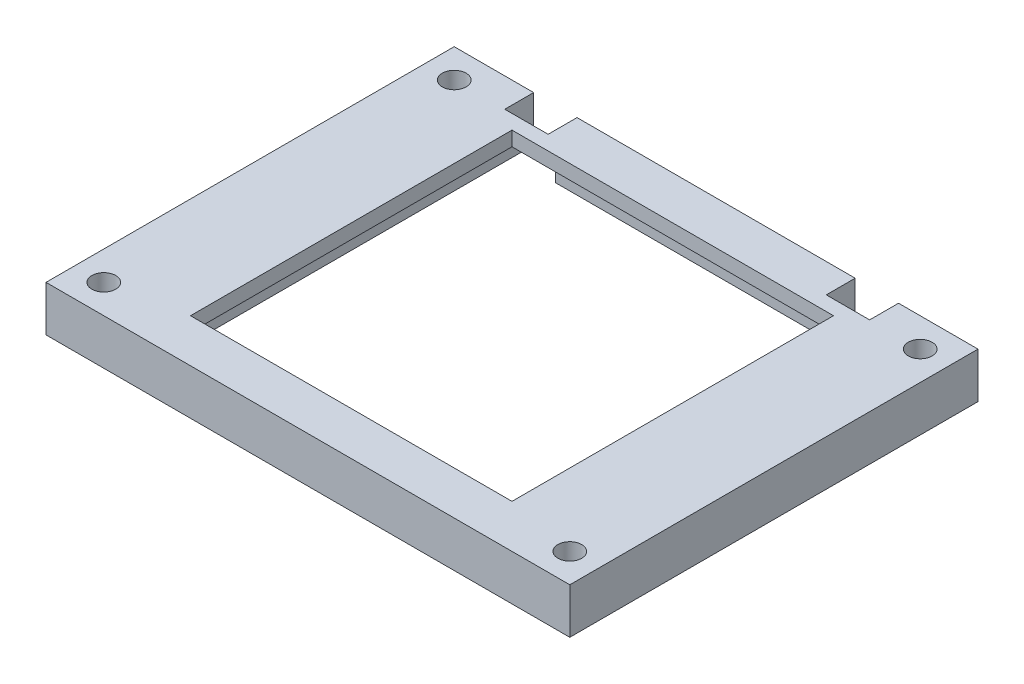
ISO-10303-21;
HEADER;
FILE_DESCRIPTION(('STEP AP214'),'2;1');
FILE_NAME('part.step','',(''),(''),'','','');
FILE_SCHEMA(('AUTOMOTIVE_DESIGN { 1 0 10303 214 1 1 1 1 }'));
ENDSEC;
DATA;
#1=APPLICATION_CONTEXT('core data for automotive mechanical design processes');
#2=APPLICATION_PROTOCOL_DEFINITION('international standard','automotive_design',2000,#1);
#3=PRODUCT_CONTEXT('',#1,'mechanical');
#4=PRODUCT('Part','Part','',(#3));
#5=PRODUCT_RELATED_PRODUCT_CATEGORY('part','',(#4));
#6=PRODUCT_DEFINITION_FORMATION('','',#4);
#7=PRODUCT_DEFINITION_CONTEXT('part definition',#1,'design');
#8=PRODUCT_DEFINITION('design','',#6,#7);
#9=PRODUCT_DEFINITION_SHAPE('','',#8);
#10=(LENGTH_UNIT() NAMED_UNIT(*) SI_UNIT(.MILLI.,.METRE.));
#11=(NAMED_UNIT(*) PLANE_ANGLE_UNIT() SI_UNIT($,.RADIAN.));
#12=(NAMED_UNIT(*) SI_UNIT($,.STERADIAN.) SOLID_ANGLE_UNIT());
#13=UNCERTAINTY_MEASURE_WITH_UNIT(LENGTH_MEASURE(1.E-05),#10,'distance_accuracy_value','');
#14=(GEOMETRIC_REPRESENTATION_CONTEXT(3) GLOBAL_UNCERTAINTY_ASSIGNED_CONTEXT((#13)) GLOBAL_UNIT_ASSIGNED_CONTEXT((#10,
#11,#12)) REPRESENTATION_CONTEXT('',''));
#15=CARTESIAN_POINT('',(0.,0.,0.));
#16=DIRECTION('',(0.,0.,1.));
#17=DIRECTION('',(1.,0.,0.));
#18=AXIS2_PLACEMENT_3D('',#15,#16,#17);
#19=CARTESIAN_POINT('',(0.,8.6,-28.25));
#20=DIRECTION('',(0.,0.,-1.));
#21=DIRECTION('',(-1.,0.,0.));
#22=AXIS2_PLACEMENT_3D('',#19,#20,#21);
#23=PLANE('',#22);
#24=DIRECTION('',(0.,1.,0.));
#25=VECTOR('',#24,1.);
#26=CARTESIAN_POINT('',(25.25,8.6,-28.25));
#27=LINE('',#26,#25);
#28=CARTESIAN_POINT('',(25.25,2.3,-28.25));
#29=VERTEX_POINT('',#28);
#30=CARTESIAN_POINT('',(25.25,8.6,-28.25));
#31=VERTEX_POINT('',#30);
#32=EDGE_CURVE('E286',#29,#31,#27,.T.);
#33=ORIENTED_EDGE('',*,*,#32,.T.);
#34=DIRECTION('',(1.,0.,0.));
#35=VECTOR('',#34,1.);
#36=CARTESIAN_POINT('',(0.,8.6,-28.25));
#37=LINE('',#36,#35);
#38=CARTESIAN_POINT('',(36.25,8.6,-28.25));
#39=VERTEX_POINT('',#38);
#40=EDGE_CURVE('E414',#31,#39,#37,.T.);
#41=ORIENTED_EDGE('',*,*,#40,.T.);
#42=DIRECTION('',(0.,-1.,0.));
#43=VECTOR('',#42,1.);
#44=CARTESIAN_POINT('',(36.25,8.6,-28.25));
#45=LINE('',#44,#43);
#46=CARTESIAN_POINT('',(36.25,2.3,-28.25));
#47=VERTEX_POINT('',#46);
#48=EDGE_CURVE('E283',#39,#47,#45,.T.);
#49=ORIENTED_EDGE('',*,*,#48,.T.);
#50=DIRECTION('',(1.,0.,0.));
#51=VECTOR('',#50,1.);
#52=CARTESIAN_POINT('',(0.,2.3,-28.25));
#53=LINE('',#52,#51);
#54=EDGE_CURVE('E75',#29,#47,#53,.T.);
#55=ORIENTED_EDGE('',*,*,#54,.F.);
#56=EDGE_LOOP('',(#33,#41,#49,#55));
#57=FACE_BOUND('',#56,.T.);
#58=ADVANCED_FACE('F71',(#57),#23,.T.);
#59=CARTESIAN_POINT('',(-19.25,8.6,-28.25));
#60=VERTEX_POINT('',#59);
#61=CARTESIAN_POINT('',(19.25,8.6,-28.25));
#62=VERTEX_POINT('',#61);
#63=EDGE_CURVE('E420',#60,#62,#37,.T.);
#64=ORIENTED_EDGE('',*,*,#63,.T.);
#65=DIRECTION('',(0.,1.,0.));
#66=VECTOR('',#65,1.);
#67=CARTESIAN_POINT('',(19.25,6.6,-28.25));
#68=LINE('',#67,#66);
#69=CARTESIAN_POINT('',(19.25,2.3,-28.25));
#70=VERTEX_POINT('',#69);
#71=EDGE_CURVE('E227',#70,#62,#68,.T.);
#72=ORIENTED_EDGE('',*,*,#71,.F.);
#73=DIRECTION('',(-1.,0.,0.));
#74=VECTOR('',#73,1.);
#75=CARTESIAN_POINT('',(0.,2.3,-28.25));
#76=LINE('',#75,#74);
#77=CARTESIAN_POINT('',(-19.25,2.3,-28.25));
#78=VERTEX_POINT('',#77);
#79=EDGE_CURVE('E309',#70,#78,#76,.T.);
#80=ORIENTED_EDGE('',*,*,#79,.T.);
#81=DIRECTION('',(0.,-1.,0.));
#82=VECTOR('',#81,1.);
#83=CARTESIAN_POINT('',(-19.25,6.6,-28.25));
#84=LINE('',#83,#82);
#85=EDGE_CURVE('E291',#60,#78,#84,.T.);
#86=ORIENTED_EDGE('',*,*,#85,.F.);
#87=EDGE_LOOP('',(#64,#72,#80,#86));
#88=FACE_BOUND('',#87,.T.);
#89=ADVANCED_FACE('F495',(#88),#23,.T.);
#90=CARTESIAN_POINT('',(25.25,8.6,0.));
#91=DIRECTION('',(1.,0.,0.));
#92=DIRECTION('',(0.,0.,-1.));
#93=AXIS2_PLACEMENT_3D('',#90,#91,#92);
#94=PLANE('',#93);
#95=DIRECTION('',(0.,0.,-1.));
#96=VECTOR('',#95,1.);
#97=CARTESIAN_POINT('',(25.25,6.6,-25.25));
#98=LINE('',#97,#96);
#99=CARTESIAN_POINT('',(25.25,6.6,25.25));
#100=VERTEX_POINT('',#99);
#101=CARTESIAN_POINT('',(25.25,6.6,-24.25));
#102=VERTEX_POINT('',#101);
#103=EDGE_CURVE('E395',#100,#102,#98,.T.);
#104=ORIENTED_EDGE('',*,*,#103,.T.);
#105=DIRECTION('',(0.,-1.,0.));
#106=VECTOR('',#105,1.);
#107=CARTESIAN_POINT('',(25.25,2.3,-24.25));
#108=LINE('',#107,#106);
#109=CARTESIAN_POINT('',(25.25,8.6,-24.25));
#110=VERTEX_POINT('',#109);
#111=EDGE_CURVE('E220',#110,#102,#108,.T.);
#112=ORIENTED_EDGE('',*,*,#111,.F.);
#113=DIRECTION('',(0.,0.,-1.));
#114=VECTOR('',#113,1.);
#115=CARTESIAN_POINT('',(25.25,8.6,-24.25));
#116=LINE('',#115,#114);
#117=EDGE_CURVE('E232',#110,#31,#116,.T.);
#118=ORIENTED_EDGE('',*,*,#117,.T.);
#119=ORIENTED_EDGE('',*,*,#32,.F.);
#120=DIRECTION('',(0.,0.,-1.));
#121=VECTOR('',#120,1.);
#122=CARTESIAN_POINT('',(25.25,2.3,0.));
#123=LINE('',#122,#121);
#124=CARTESIAN_POINT('',(25.25,2.3,25.25));
#125=VERTEX_POINT('',#124);
#126=EDGE_CURVE('E327',#125,#29,#123,.T.);
#127=ORIENTED_EDGE('',*,*,#126,.F.);
#128=DIRECTION('',(0.,-1.,0.));
#129=VECTOR('',#128,1.);
#130=CARTESIAN_POINT('',(25.25,8.6,25.25));
#131=LINE('',#130,#129);
#132=EDGE_CURVE('E447',#100,#125,#131,.T.);
#133=ORIENTED_EDGE('',*,*,#132,.F.);
#134=EDGE_LOOP('',(#104,#112,#118,#119,#127,#133));
#135=FACE_BOUND('',#134,.T.);
#136=ADVANCED_FACE('F491',(#135),#94,.F.);
#137=CARTESIAN_POINT('',(-25.25,8.6,0.));
#138=DIRECTION('',(1.,0.,0.));
#139=DIRECTION('',(0.,0.,-1.));
#140=AXIS2_PLACEMENT_3D('',#137,#138,#139);
#141=PLANE('',#140);
#142=DIRECTION('',(0.,0.,-1.));
#143=VECTOR('',#142,1.);
#144=CARTESIAN_POINT('',(-25.25,2.3,0.));
#145=LINE('',#144,#143);
#146=CARTESIAN_POINT('',(-25.25,2.3,25.25));
#147=VERTEX_POINT('',#146);
#148=CARTESIAN_POINT('',(-25.25,2.3,-28.25));
#149=VERTEX_POINT('',#148);
#150=EDGE_CURVE('E87',#147,#149,#145,.T.);
#151=ORIENTED_EDGE('',*,*,#150,.T.);
#152=DIRECTION('',(0.,1.,0.));
#153=VECTOR('',#152,1.);
#154=CARTESIAN_POINT('',(-25.25,8.6,-28.25));
#155=LINE('',#154,#153);
#156=CARTESIAN_POINT('',(-25.25,8.6,-28.25));
#157=VERTEX_POINT('',#156);
#158=EDGE_CURVE('E295',#149,#157,#155,.T.);
#159=ORIENTED_EDGE('',*,*,#158,.T.);
#160=DIRECTION('',(0.,0.,-1.));
#161=VECTOR('',#160,1.);
#162=CARTESIAN_POINT('',(-25.25,8.6,-24.25));
#163=LINE('',#162,#161);
#164=CARTESIAN_POINT('',(-25.25,8.6,-24.25));
#165=VERTEX_POINT('',#164);
#166=EDGE_CURVE('E245',#165,#157,#163,.T.);
#167=ORIENTED_EDGE('',*,*,#166,.F.);
#168=DIRECTION('',(0.,1.,0.));
#169=VECTOR('',#168,1.);
#170=CARTESIAN_POINT('',(-25.25,2.3,-24.25));
#171=LINE('',#170,#169);
#172=CARTESIAN_POINT('',(-25.25,6.6,-24.25));
#173=VERTEX_POINT('',#172);
#174=EDGE_CURVE('E257',#173,#165,#171,.T.);
#175=ORIENTED_EDGE('',*,*,#174,.F.);
#176=DIRECTION('',(0.,0.,1.));
#177=VECTOR('',#176,1.);
#178=CARTESIAN_POINT('',(-25.25,6.6,-25.25));
#179=LINE('',#178,#177);
#180=CARTESIAN_POINT('',(-25.25,6.6,25.25));
#181=VERTEX_POINT('',#180);
#182=EDGE_CURVE('E403',#173,#181,#179,.T.);
#183=ORIENTED_EDGE('',*,*,#182,.T.);
#184=DIRECTION('',(0.,-1.,0.));
#185=VECTOR('',#184,1.);
#186=CARTESIAN_POINT('',(-25.25,8.6,25.25));
#187=LINE('',#186,#185);
#188=EDGE_CURVE('E444',#181,#147,#187,.T.);
#189=ORIENTED_EDGE('',*,*,#188,.T.);
#190=EDGE_LOOP('',(#151,#159,#167,#175,#183,#189));
#191=FACE_BOUND('',#190,.T.);
#192=ADVANCED_FACE('F475',(#191),#141,.T.);
#193=CARTESIAN_POINT('',(-19.25,6.6,-19.8890560934738));
#194=DIRECTION('',(-1.,0.,0.));
#195=DIRECTION('',(0.,0.,1.));
#196=AXIS2_PLACEMENT_3D('',#193,#194,#195);
#197=PLANE('',#196);
#198=DIRECTION('',(0.,1.,0.));
#199=VECTOR('',#198,1.);
#200=CARTESIAN_POINT('',(-19.25,8.6,-25.25));
#201=LINE('',#200,#199);
#202=CARTESIAN_POINT('',(-19.25,2.3,-25.25));
#203=VERTEX_POINT('',#202);
#204=CARTESIAN_POINT('',(-19.25,6.6,-25.25));
#205=VERTEX_POINT('',#204);
#206=EDGE_CURVE('E349',#203,#205,#201,.T.);
#207=ORIENTED_EDGE('',*,*,#206,.T.);
#208=DIRECTION('',(0.,0.,-1.));
#209=VECTOR('',#208,1.);
#210=CARTESIAN_POINT('',(-19.25,6.6,0.));
#211=LINE('',#210,#209);
#212=CARTESIAN_POINT('',(-19.25,6.6,-24.25));
#213=VERTEX_POINT('',#212);
#214=EDGE_CURVE('E243',#213,#205,#211,.T.);
#215=ORIENTED_EDGE('',*,*,#214,.F.);
#216=DIRECTION('',(0.,-1.,0.));
#217=VECTOR('',#216,1.);
#218=CARTESIAN_POINT('',(-19.25,2.3,-24.25));
#219=LINE('',#218,#217);
#220=CARTESIAN_POINT('',(-19.25,8.6,-24.25));
#221=VERTEX_POINT('',#220);
#222=EDGE_CURVE('E260',#221,#213,#219,.T.);
#223=ORIENTED_EDGE('',*,*,#222,.F.);
#224=DIRECTION('',(0.,0.,-1.));
#225=VECTOR('',#224,1.);
#226=CARTESIAN_POINT('',(-19.25,8.6,-24.25));
#227=LINE('',#226,#225);
#228=EDGE_CURVE('E250',#221,#60,#227,.T.);
#229=ORIENTED_EDGE('',*,*,#228,.T.);
#230=ORIENTED_EDGE('',*,*,#85,.T.);
#231=DIRECTION('',(0.,0.,1.));
#232=VECTOR('',#231,1.);
#233=CARTESIAN_POINT('',(-19.25,2.3,-19.8890560934738));
#234=LINE('',#233,#232);
#235=EDGE_CURVE('E306',#78,#203,#234,.T.);
#236=ORIENTED_EDGE('',*,*,#235,.T.);
#237=EDGE_LOOP('',(#207,#215,#223,#229,#230,#236));
#238=FACE_BOUND('',#237,.T.);
#239=ADVANCED_FACE('F498',(#238),#197,.T.);
#240=CARTESIAN_POINT('',(19.25,6.6,-19.8890560934738));
#241=DIRECTION('',(1.,0.,0.));
#242=DIRECTION('',(0.,0.,-1.));
#243=AXIS2_PLACEMENT_3D('',#240,#241,#242);
#244=PLANE('',#243);
#245=DIRECTION('',(0.,0.,-1.));
#246=VECTOR('',#245,1.);
#247=CARTESIAN_POINT('',(19.25,2.3,-19.8890560934738));
#248=LINE('',#247,#246);
#249=CARTESIAN_POINT('',(19.25,2.3,-25.25));
#250=VERTEX_POINT('',#249);
#251=EDGE_CURVE('E450',#250,#70,#248,.T.);
#252=ORIENTED_EDGE('',*,*,#251,.T.);
#253=ORIENTED_EDGE('',*,*,#71,.T.);
#254=DIRECTION('',(0.,0.,-1.));
#255=VECTOR('',#254,1.);
#256=CARTESIAN_POINT('',(19.25,8.6,-24.25));
#257=LINE('',#256,#255);
#258=CARTESIAN_POINT('',(19.25,8.6,-24.25));
#259=VERTEX_POINT('',#258);
#260=EDGE_CURVE('E223',#259,#62,#257,.T.);
#261=ORIENTED_EDGE('',*,*,#260,.F.);
#262=DIRECTION('',(0.,1.,0.));
#263=VECTOR('',#262,1.);
#264=CARTESIAN_POINT('',(19.25,2.3,-24.25));
#265=LINE('',#264,#263);
#266=CARTESIAN_POINT('',(19.25,6.6,-24.25));
#267=VERTEX_POINT('',#266);
#268=EDGE_CURVE('E209',#267,#259,#265,.T.);
#269=ORIENTED_EDGE('',*,*,#268,.F.);
#270=DIRECTION('',(0.,0.,1.));
#271=VECTOR('',#270,1.);
#272=CARTESIAN_POINT('',(19.25,6.6,0.));
#273=LINE('',#272,#271);
#274=CARTESIAN_POINT('',(19.25,6.6,-25.25));
#275=VERTEX_POINT('',#274);
#276=EDGE_CURVE('E266',#275,#267,#273,.T.);
#277=ORIENTED_EDGE('',*,*,#276,.F.);
#278=DIRECTION('',(0.,-1.,0.));
#279=VECTOR('',#278,1.);
#280=CARTESIAN_POINT('',(19.25,8.6,-25.25));
#281=LINE('',#280,#279);
#282=EDGE_CURVE('E345',#275,#250,#281,.T.);
#283=ORIENTED_EDGE('',*,*,#282,.T.);
#284=EDGE_LOOP('',(#252,#253,#261,#269,#277,#283));
#285=FACE_BOUND('',#284,.T.);
#286=ADVANCED_FACE('F225',(#285),#244,.T.);
#287=CARTESIAN_POINT('',(0.,8.6,0.));
#288=DIRECTION('',(0.,1.,0.));
#289=DIRECTION('',(0.,0.,1.));
#290=AXIS2_PLACEMENT_3D('',#287,#288,#289);
#291=PLANE('',#290);
#292=ORIENTED_EDGE('',*,*,#117,.F.);
#293=DIRECTION('',(1.,0.,0.));
#294=VECTOR('',#293,1.);
#295=CARTESIAN_POINT('',(25.25,8.6,-24.25));
#296=LINE('',#295,#294);
#297=EDGE_CURVE('E213',#259,#110,#296,.T.);
#298=ORIENTED_EDGE('',*,*,#297,.F.);
#299=ORIENTED_EDGE('',*,*,#260,.T.);
#300=ORIENTED_EDGE('',*,*,#63,.F.);
#301=ORIENTED_EDGE('',*,*,#228,.F.);
#302=DIRECTION('',(1.,0.,0.));
#303=VECTOR('',#302,1.);
#304=CARTESIAN_POINT('',(-19.25,8.6,-24.25));
#305=LINE('',#304,#303);
#306=EDGE_CURVE('E249',#165,#221,#305,.T.);
#307=ORIENTED_EDGE('',*,*,#306,.F.);
#308=ORIENTED_EDGE('',*,*,#166,.T.);
#309=CARTESIAN_POINT('',(-36.25,8.6,-28.25));
#310=VERTEX_POINT('',#309);
#311=EDGE_CURVE('E415',#310,#157,#37,.T.);
#312=ORIENTED_EDGE('',*,*,#311,.F.);
#313=DIRECTION('',(0.,0.,-1.));
#314=VECTOR('',#313,1.);
#315=CARTESIAN_POINT('',(-36.25,8.6,0.));
#316=LINE('',#315,#314);
#317=CARTESIAN_POINT('',(-36.25,8.6,28.25));
#318=VERTEX_POINT('',#317);
#319=EDGE_CURVE('E419',#318,#310,#316,.T.);
#320=ORIENTED_EDGE('',*,*,#319,.F.);
#321=DIRECTION('',(1.,0.,0.));
#322=VECTOR('',#321,1.);
#323=CARTESIAN_POINT('',(0.,8.6,28.25));
#324=LINE('',#323,#322);
#325=CARTESIAN_POINT('',(36.25,8.6,28.25));
#326=VERTEX_POINT('',#325);
#327=EDGE_CURVE('E424',#318,#326,#324,.T.);
#328=ORIENTED_EDGE('',*,*,#327,.T.);
#329=DIRECTION('',(0.,0.,-1.));
#330=VECTOR('',#329,1.);
#331=CARTESIAN_POINT('',(36.25,8.6,0.));
#332=LINE('',#331,#330);
#333=EDGE_CURVE('E410',#326,#39,#332,.T.);
#334=ORIENTED_EDGE('',*,*,#333,.T.);
#335=ORIENTED_EDGE('',*,*,#40,.F.);
#336=EDGE_LOOP('',(#292,#298,#299,#300,#301,#307,#308,#312,#320,#328,#334,#335));
#337=FACE_BOUND('',#336,.T.);
#338=CARTESIAN_POINT('',(32.25,8.6,24.25));
#339=DIRECTION('',(0.,1.,0.));
#340=DIRECTION('',(0.,0.,1.));
#341=AXIS2_PLACEMENT_3D('',#338,#339,#340);
#342=CIRCLE('',#341,1.65);
#343=CARTESIAN_POINT('',(32.25,8.6,25.9));
#344=VERTEX_POINT('',#343);
#345=EDGE_CURVE('E428',#344,#344,#342,.T.);
#346=ORIENTED_EDGE('',*,*,#345,.F.);
#347=EDGE_LOOP('',(#346));
#348=FACE_BOUND('',#347,.T.);
#349=CARTESIAN_POINT('',(-32.25,8.6,24.25));
#350=DIRECTION('',(0.,1.,0.));
#351=DIRECTION('',(0.,0.,1.));
#352=AXIS2_PLACEMENT_3D('',#349,#350,#351);
#353=CIRCLE('',#352,1.65);
#354=CARTESIAN_POINT('',(-32.25,8.6,25.9));
#355=VERTEX_POINT('',#354);
#356=EDGE_CURVE('E432',#355,#355,#353,.F.);
#357=ORIENTED_EDGE('',*,*,#356,.T.);
#358=EDGE_LOOP('',(#357));
#359=FACE_BOUND('',#358,.T.);
#360=CARTESIAN_POINT('',(-32.25,8.6,-24.25));
#361=DIRECTION('',(0.,1.,0.));
#362=DIRECTION('',(0.,0.,1.));
#363=AXIS2_PLACEMENT_3D('',#360,#361,#362);
#364=CIRCLE('',#363,1.65);
#365=CARTESIAN_POINT('',(-32.25,8.6,-22.6));
#366=VERTEX_POINT('',#365);
#367=EDGE_CURVE('E436',#366,#366,#364,.T.);
#368=ORIENTED_EDGE('',*,*,#367,.F.);
#369=EDGE_LOOP('',(#368));
#370=FACE_BOUND('',#369,.T.);
#371=CARTESIAN_POINT('',(32.25,8.6,-24.25));
#372=DIRECTION('',(0.,1.,0.));
#373=DIRECTION('',(0.,0.,1.));
#374=AXIS2_PLACEMENT_3D('',#371,#372,#373);
#375=CIRCLE('',#374,1.65);
#376=CARTESIAN_POINT('',(32.25,8.6,-22.6));
#377=VERTEX_POINT('',#376);
#378=EDGE_CURVE('E440',#377,#377,#375,.F.);
#379=ORIENTED_EDGE('',*,*,#378,.T.);
#380=EDGE_LOOP('',(#379));
#381=FACE_BOUND('',#380,.T.);
#382=DIRECTION('',(-1.,0.,0.));
#383=VECTOR('',#382,1.);
#384=CARTESIAN_POINT('',(-22.25,8.6,-22.25));
#385=LINE('',#384,#383);
#386=CARTESIAN_POINT('',(22.25,8.6,-22.25));
#387=VERTEX_POINT('',#386);
#388=CARTESIAN_POINT('',(-22.25,8.6,-22.25));
#389=VERTEX_POINT('',#388);
#390=EDGE_CURVE('E357',#387,#389,#385,.T.);
#391=ORIENTED_EDGE('',*,*,#390,.F.);
#392=DIRECTION('',(0.,0.,-1.));
#393=VECTOR('',#392,1.);
#394=CARTESIAN_POINT('',(22.25,8.6,-22.25));
#395=LINE('',#394,#393);
#396=CARTESIAN_POINT('',(22.25,8.6,22.25));
#397=VERTEX_POINT('',#396);
#398=EDGE_CURVE('E354',#397,#387,#395,.T.);
#399=ORIENTED_EDGE('',*,*,#398,.F.);
#400=DIRECTION('',(1.,0.,0.));
#401=VECTOR('',#400,1.);
#402=CARTESIAN_POINT('',(-22.25,8.6,22.25));
#403=LINE('',#402,#401);
#404=CARTESIAN_POINT('',(-22.25,8.6,22.25));
#405=VERTEX_POINT('',#404);
#406=EDGE_CURVE('E365',#405,#397,#403,.T.);
#407=ORIENTED_EDGE('',*,*,#406,.F.);
#408=DIRECTION('',(0.,0.,1.));
#409=VECTOR('',#408,1.);
#410=CARTESIAN_POINT('',(-22.25,8.6,-22.25));
#411=LINE('',#410,#409);
#412=EDGE_CURVE('E361',#389,#405,#411,.T.);
#413=ORIENTED_EDGE('',*,*,#412,.F.);
#414=EDGE_LOOP('',(#391,#399,#407,#413));
#415=FACE_BOUND('',#414,.T.);
#416=ADVANCED_FACE('F234',(#337,#348,#359,#370,#381,#415),#291,.T.);
#417=CARTESIAN_POINT('',(0.,6.6,0.));
#418=DIRECTION('',(0.,1.,0.));
#419=DIRECTION('',(0.,0.,1.));
#420=AXIS2_PLACEMENT_3D('',#417,#418,#419);
#421=PLANE('',#420);
#422=DIRECTION('',(-1.,0.,0.));
#423=VECTOR('',#422,1.);
#424=CARTESIAN_POINT('',(-22.25,6.6,-22.25));
#425=LINE('',#424,#423);
#426=CARTESIAN_POINT('',(22.25,6.6,-22.25));
#427=VERTEX_POINT('',#426);
#428=CARTESIAN_POINT('',(-22.25,6.6,-22.25));
#429=VERTEX_POINT('',#428);
#430=EDGE_CURVE('E371',#427,#429,#425,.T.);
#431=ORIENTED_EDGE('',*,*,#430,.T.);
#432=DIRECTION('',(0.,0.,1.));
#433=VECTOR('',#432,1.);
#434=CARTESIAN_POINT('',(-22.25,6.6,-22.25));
#435=LINE('',#434,#433);
#436=CARTESIAN_POINT('',(-22.25,6.6,22.25));
#437=VERTEX_POINT('',#436);
#438=EDGE_CURVE('E374',#429,#437,#435,.T.);
#439=ORIENTED_EDGE('',*,*,#438,.T.);
#440=DIRECTION('',(1.,0.,0.));
#441=VECTOR('',#440,1.);
#442=CARTESIAN_POINT('',(-22.25,6.6,22.25));
#443=LINE('',#442,#441);
#444=CARTESIAN_POINT('',(22.25,6.6,22.25));
#445=VERTEX_POINT('',#444);
#446=EDGE_CURVE('E358',#437,#445,#443,.T.);
#447=ORIENTED_EDGE('',*,*,#446,.T.);
#448=DIRECTION('',(0.,0.,-1.));
#449=VECTOR('',#448,1.);
#450=CARTESIAN_POINT('',(22.25,6.6,-22.25));
#451=LINE('',#450,#449);
#452=EDGE_CURVE('E353',#445,#427,#451,.T.);
#453=ORIENTED_EDGE('',*,*,#452,.T.);
#454=EDGE_LOOP('',(#431,#439,#447,#453));
#455=FACE_BOUND('',#454,.T.);
#456=DIRECTION('',(-1.,0.,0.));
#457=VECTOR('',#456,1.);
#458=CARTESIAN_POINT('',(-25.25,6.6,-25.25));
#459=LINE('',#458,#457);
#460=EDGE_CURVE('E399',#275,#205,#459,.T.);
#461=ORIENTED_EDGE('',*,*,#460,.F.);
#462=ORIENTED_EDGE('',*,*,#276,.T.);
#463=DIRECTION('',(1.,0.,0.));
#464=VECTOR('',#463,1.);
#465=CARTESIAN_POINT('',(0.,6.6,-24.25));
#466=LINE('',#465,#464);
#467=EDGE_CURVE('E216',#267,#102,#466,.T.);
#468=ORIENTED_EDGE('',*,*,#467,.T.);
#469=ORIENTED_EDGE('',*,*,#103,.F.);
#470=DIRECTION('',(1.,0.,0.));
#471=VECTOR('',#470,1.);
#472=CARTESIAN_POINT('',(-25.25,6.6,25.25));
#473=LINE('',#472,#471);
#474=EDGE_CURVE('E406',#181,#100,#473,.T.);
#475=ORIENTED_EDGE('',*,*,#474,.F.);
#476=ORIENTED_EDGE('',*,*,#182,.F.);
#477=DIRECTION('',(1.,0.,0.));
#478=VECTOR('',#477,1.);
#479=CARTESIAN_POINT('',(0.,6.6,-24.25));
#480=LINE('',#479,#478);
#481=EDGE_CURVE('E269',#173,#213,#480,.T.);
#482=ORIENTED_EDGE('',*,*,#481,.T.);
#483=ORIENTED_EDGE('',*,*,#214,.T.);
#484=EDGE_LOOP('',(#461,#462,#468,#469,#475,#476,#482,#483));
#485=FACE_BOUND('',#484,.T.);
#486=ADVANCED_FACE('F485',(#455,#485),#421,.F.);
#487=CARTESIAN_POINT('',(0.,2.3,0.));
#488=DIRECTION('',(0.,-1.,0.));
#489=DIRECTION('',(0.,0.,-1.));
#490=AXIS2_PLACEMENT_3D('',#487,#488,#489);
#491=PLANE('',#490);
#492=ORIENTED_EDGE('',*,*,#235,.F.);
#493=ORIENTED_EDGE('',*,*,#79,.F.);
#494=ORIENTED_EDGE('',*,*,#251,.F.);
#495=DIRECTION('',(-1.,0.,0.));
#496=VECTOR('',#495,1.);
#497=CARTESIAN_POINT('',(0.,2.3,-25.25));
#498=LINE('',#497,#496);
#499=EDGE_CURVE('E302',#250,#203,#498,.T.);
#500=ORIENTED_EDGE('',*,*,#499,.T.);
#501=EDGE_LOOP('',(#492,#493,#494,#500));
#502=FACE_BOUND('',#501,.T.);
#503=ADVANCED_FACE('F505',(#502),#491,.T.);
#504=DIRECTION('',(0.,0.,1.));
#505=VECTOR('',#504,1.);
#506=CARTESIAN_POINT('',(36.25,2.3,0.));
#507=LINE('',#506,#505);
#508=CARTESIAN_POINT('',(36.25,2.3,28.25));
#509=VERTEX_POINT('',#508);
#510=EDGE_CURVE('E330',#47,#509,#507,.T.);
#511=ORIENTED_EDGE('',*,*,#510,.T.);
#512=DIRECTION('',(-1.,0.,0.));
#513=VECTOR('',#512,1.);
#514=CARTESIAN_POINT('',(0.,2.3,28.25));
#515=LINE('',#514,#513);
#516=CARTESIAN_POINT('',(-36.25,2.3,28.25));
#517=VERTEX_POINT('',#516);
#518=EDGE_CURVE('E95',#509,#517,#515,.T.);
#519=ORIENTED_EDGE('',*,*,#518,.T.);
#520=DIRECTION('',(0.,0.,-1.));
#521=VECTOR('',#520,1.);
#522=CARTESIAN_POINT('',(-36.25,2.3,0.));
#523=LINE('',#522,#521);
#524=CARTESIAN_POINT('',(-36.25,2.3,-28.25));
#525=VERTEX_POINT('',#524);
#526=EDGE_CURVE('E318',#517,#525,#523,.T.);
#527=ORIENTED_EDGE('',*,*,#526,.T.);
#528=EDGE_CURVE('E12',#525,#149,#53,.T.);
#529=ORIENTED_EDGE('',*,*,#528,.T.);
#530=ORIENTED_EDGE('',*,*,#150,.F.);
#531=DIRECTION('',(-1.,0.,0.));
#532=VECTOR('',#531,1.);
#533=CARTESIAN_POINT('',(0.,2.3,25.25));
#534=LINE('',#533,#532);
#535=EDGE_CURVE('E323',#125,#147,#534,.T.);
#536=ORIENTED_EDGE('',*,*,#535,.F.);
#537=ORIENTED_EDGE('',*,*,#126,.T.);
#538=ORIENTED_EDGE('',*,*,#54,.T.);
#539=EDGE_LOOP('',(#511,#519,#527,#529,#530,#536,#537,#538));
#540=FACE_BOUND('',#539,.T.);
#541=CARTESIAN_POINT('',(-32.25,2.3,-24.25));
#542=DIRECTION('',(0.,-1.,0.));
#543=DIRECTION('',(0.,0.,-1.));
#544=AXIS2_PLACEMENT_3D('',#541,#542,#543);
#545=CIRCLE('',#544,1.65);
#546=CARTESIAN_POINT('',(-32.25,2.3,-25.9));
#547=VERTEX_POINT('',#546);
#548=EDGE_CURVE('E341',#547,#547,#545,.T.);
#549=ORIENTED_EDGE('',*,*,#548,.F.);
#550=EDGE_LOOP('',(#549));
#551=FACE_BOUND('',#550,.T.);
#552=CARTESIAN_POINT('',(32.25,2.3,24.25));
#553=DIRECTION('',(0.,-1.,0.));
#554=DIRECTION('',(0.,0.,-1.));
#555=AXIS2_PLACEMENT_3D('',#552,#553,#554);
#556=CIRCLE('',#555,1.65);
#557=CARTESIAN_POINT('',(32.25,2.3,22.6));
#558=VERTEX_POINT('',#557);
#559=EDGE_CURVE('E333',#558,#558,#556,.T.);
#560=ORIENTED_EDGE('',*,*,#559,.F.);
#561=EDGE_LOOP('',(#560));
#562=FACE_BOUND('',#561,.T.);
#563=CARTESIAN_POINT('',(32.25,2.3,-24.25));
#564=DIRECTION('',(0.,-1.,0.));
#565=DIRECTION('',(0.,0.,-1.));
#566=AXIS2_PLACEMENT_3D('',#563,#564,#565);
#567=CIRCLE('',#566,1.65);
#568=CARTESIAN_POINT('',(32.25,2.3,-25.9));
#569=VERTEX_POINT('',#568);
#570=EDGE_CURVE('E312',#569,#569,#567,.F.);
#571=ORIENTED_EDGE('',*,*,#570,.T.);
#572=EDGE_LOOP('',(#571));
#573=FACE_BOUND('',#572,.T.);
#574=CARTESIAN_POINT('',(-32.25,2.3,24.25));
#575=DIRECTION('',(0.,-1.,0.));
#576=DIRECTION('',(0.,0.,-1.));
#577=AXIS2_PLACEMENT_3D('',#574,#575,#576);
#578=CIRCLE('',#577,1.65);
#579=CARTESIAN_POINT('',(-32.25,2.3,22.6));
#580=VERTEX_POINT('',#579);
#581=EDGE_CURVE('E337',#580,#580,#578,.F.);
#582=ORIENTED_EDGE('',*,*,#581,.T.);
#583=EDGE_LOOP('',(#582));
#584=FACE_BOUND('',#583,.T.);
#585=ADVANCED_FACE('F456',(#540,#551,#562,#573,#584),#491,.T.);
#586=CARTESIAN_POINT('',(0.,8.6,-25.25));
#587=DIRECTION('',(0.,0.,-1.));
#588=DIRECTION('',(-1.,0.,0.));
#589=AXIS2_PLACEMENT_3D('',#586,#587,#588);
#590=PLANE('',#589);
#591=ORIENTED_EDGE('',*,*,#499,.F.);
#592=ORIENTED_EDGE('',*,*,#282,.F.);
#593=ORIENTED_EDGE('',*,*,#460,.T.);
#594=ORIENTED_EDGE('',*,*,#206,.F.);
#595=EDGE_LOOP('',(#591,#592,#593,#594));
#596=FACE_BOUND('',#595,.T.);
#597=ADVANCED_FACE('F503',(#596),#590,.F.);
#598=CARTESIAN_POINT('',(0.,8.6,25.25));
#599=DIRECTION('',(0.,0.,-1.));
#600=DIRECTION('',(-1.,0.,0.));
#601=AXIS2_PLACEMENT_3D('',#598,#599,#600);
#602=PLANE('',#601);
#603=ORIENTED_EDGE('',*,*,#132,.T.);
#604=ORIENTED_EDGE('',*,*,#535,.T.);
#605=ORIENTED_EDGE('',*,*,#188,.F.);
#606=ORIENTED_EDGE('',*,*,#474,.T.);
#607=EDGE_LOOP('',(#603,#604,#605,#606));
#608=FACE_BOUND('',#607,.T.);
#609=ADVANCED_FACE('F489',(#608),#602,.T.);
#610=ORIENTED_EDGE('',*,*,#311,.T.);
#611=ORIENTED_EDGE('',*,*,#158,.F.);
#612=ORIENTED_EDGE('',*,*,#528,.F.);
#613=DIRECTION('',(0.,-1.,0.));
#614=VECTOR('',#613,1.);
#615=CARTESIAN_POINT('',(-36.25,8.6,-28.25));
#616=LINE('',#615,#614);
#617=EDGE_CURVE('E298',#310,#525,#616,.T.);
#618=ORIENTED_EDGE('',*,*,#617,.F.);
#619=EDGE_LOOP('',(#610,#611,#612,#618));
#620=FACE_BOUND('',#619,.T.);
#621=ADVANCED_FACE('F73',(#620),#23,.T.);
#622=CARTESIAN_POINT('',(-36.25,8.6,0.));
#623=DIRECTION('',(1.,0.,0.));
#624=DIRECTION('',(0.,0.,-1.));
#625=AXIS2_PLACEMENT_3D('',#622,#623,#624);
#626=PLANE('',#625);
#627=ORIENTED_EDGE('',*,*,#526,.F.);
#628=DIRECTION('',(0.,1.,0.));
#629=VECTOR('',#628,1.);
#630=CARTESIAN_POINT('',(-36.25,8.6,28.25));
#631=LINE('',#630,#629);
#632=EDGE_CURVE('E279',#517,#318,#631,.T.);
#633=ORIENTED_EDGE('',*,*,#632,.T.);
#634=ORIENTED_EDGE('',*,*,#319,.T.);
#635=ORIENTED_EDGE('',*,*,#617,.T.);
#636=EDGE_LOOP('',(#627,#633,#634,#635));
#637=FACE_BOUND('',#636,.T.);
#638=ADVANCED_FACE('F470',(#637),#626,.F.);
#639=CARTESIAN_POINT('',(0.,8.6,28.25));
#640=DIRECTION('',(0.,0.,-1.));
#641=DIRECTION('',(-1.,0.,0.));
#642=AXIS2_PLACEMENT_3D('',#639,#640,#641);
#643=PLANE('',#642);
#644=ORIENTED_EDGE('',*,*,#518,.F.);
#645=DIRECTION('',(0.,1.,0.));
#646=VECTOR('',#645,1.);
#647=CARTESIAN_POINT('',(36.25,8.6,28.25));
#648=LINE('',#647,#646);
#649=EDGE_CURVE('E275',#509,#326,#648,.T.);
#650=ORIENTED_EDGE('',*,*,#649,.T.);
#651=ORIENTED_EDGE('',*,*,#327,.F.);
#652=ORIENTED_EDGE('',*,*,#632,.F.);
#653=EDGE_LOOP('',(#644,#650,#651,#652));
#654=FACE_BOUND('',#653,.T.);
#655=ADVANCED_FACE('F467',(#654),#643,.F.);
#656=CARTESIAN_POINT('',(36.25,8.6,0.));
#657=DIRECTION('',(1.,0.,0.));
#658=DIRECTION('',(0.,0.,-1.));
#659=AXIS2_PLACEMENT_3D('',#656,#657,#658);
#660=PLANE('',#659);
#661=ORIENTED_EDGE('',*,*,#649,.F.);
#662=ORIENTED_EDGE('',*,*,#510,.F.);
#663=ORIENTED_EDGE('',*,*,#48,.F.);
#664=ORIENTED_EDGE('',*,*,#333,.F.);
#665=EDGE_LOOP('',(#661,#662,#663,#664));
#666=FACE_BOUND('',#665,.T.);
#667=ADVANCED_FACE('F464',(#666),#660,.T.);
#668=CARTESIAN_POINT('',(-32.25,8.6,-24.25));
#669=DIRECTION('',(0.,-1.,0.));
#670=DIRECTION('',(0.,0.,-1.));
#671=AXIS2_PLACEMENT_3D('',#668,#669,#670);
#672=CYLINDRICAL_SURFACE('',#671,1.65);
#673=ORIENTED_EDGE('',*,*,#367,.T.);
#674=EDGE_LOOP('',(#673));
#675=FACE_BOUND('',#674,.T.);
#676=ORIENTED_EDGE('',*,*,#548,.T.);
#677=EDGE_LOOP('',(#676));
#678=FACE_BOUND('',#677,.T.);
#679=ADVANCED_FACE('F542',(#675,#678),#672,.F.);
#680=CARTESIAN_POINT('',(-32.25,8.6,24.25));
#681=DIRECTION('',(0.,-1.,0.));
#682=DIRECTION('',(0.,0.,-1.));
#683=AXIS2_PLACEMENT_3D('',#680,#681,#682);
#684=CYLINDRICAL_SURFACE('',#683,1.65);
#685=ORIENTED_EDGE('',*,*,#356,.F.);
#686=EDGE_LOOP('',(#685));
#687=FACE_BOUND('',#686,.T.);
#688=ORIENTED_EDGE('',*,*,#581,.F.);
#689=EDGE_LOOP('',(#688));
#690=FACE_BOUND('',#689,.T.);
#691=ADVANCED_FACE('F675',(#687,#690),#684,.F.);
#692=CARTESIAN_POINT('',(32.25,8.6,24.25));
#693=DIRECTION('',(0.,-1.,0.));
#694=DIRECTION('',(0.,0.,-1.));
#695=AXIS2_PLACEMENT_3D('',#692,#693,#694);
#696=CYLINDRICAL_SURFACE('',#695,1.65);
#697=ORIENTED_EDGE('',*,*,#345,.T.);
#698=EDGE_LOOP('',(#697));
#699=FACE_BOUND('',#698,.T.);
#700=ORIENTED_EDGE('',*,*,#559,.T.);
#701=EDGE_LOOP('',(#700));
#702=FACE_BOUND('',#701,.T.);
#703=ADVANCED_FACE('F672',(#699,#702),#696,.F.);
#704=CARTESIAN_POINT('',(32.25,8.6,-24.25));
#705=DIRECTION('',(0.,-1.,0.));
#706=DIRECTION('',(0.,0.,-1.));
#707=AXIS2_PLACEMENT_3D('',#704,#705,#706);
#708=CYLINDRICAL_SURFACE('',#707,1.65);
#709=ORIENTED_EDGE('',*,*,#378,.F.);
#710=EDGE_LOOP('',(#709));
#711=FACE_BOUND('',#710,.T.);
#712=ORIENTED_EDGE('',*,*,#570,.F.);
#713=EDGE_LOOP('',(#712));
#714=FACE_BOUND('',#713,.T.);
#715=ADVANCED_FACE('F667',(#711,#714),#708,.F.);
#716=CARTESIAN_POINT('',(22.25,8.6,-22.25));
#717=DIRECTION('',(-1.,0.,0.));
#718=DIRECTION('',(0.,0.,1.));
#719=AXIS2_PLACEMENT_3D('',#716,#717,#718);
#720=PLANE('',#719);
#721=ORIENTED_EDGE('',*,*,#452,.F.);
#722=DIRECTION('',(0.,-1.,0.));
#723=VECTOR('',#722,1.);
#724=CARTESIAN_POINT('',(22.25,8.6,22.25));
#725=LINE('',#724,#723);
#726=EDGE_CURVE('E368',#397,#445,#725,.T.);
#727=ORIENTED_EDGE('',*,*,#726,.F.);
#728=ORIENTED_EDGE('',*,*,#398,.T.);
#729=DIRECTION('',(0.,-1.,0.));
#730=VECTOR('',#729,1.);
#731=CARTESIAN_POINT('',(22.25,8.6,-22.25));
#732=LINE('',#731,#730);
#733=EDGE_CURVE('E391',#387,#427,#732,.T.);
#734=ORIENTED_EDGE('',*,*,#733,.T.);
#735=EDGE_LOOP('',(#721,#727,#728,#734));
#736=FACE_BOUND('',#735,.T.);
#737=ADVANCED_FACE('F665',(#736),#720,.T.);
#738=CARTESIAN_POINT('',(-22.25,8.6,-22.25));
#739=DIRECTION('',(0.,0.,1.));
#740=DIRECTION('',(1.,0.,0.));
#741=AXIS2_PLACEMENT_3D('',#738,#739,#740);
#742=PLANE('',#741);
#743=ORIENTED_EDGE('',*,*,#430,.F.);
#744=ORIENTED_EDGE('',*,*,#733,.F.);
#745=ORIENTED_EDGE('',*,*,#390,.T.);
#746=DIRECTION('',(0.,-1.,0.));
#747=VECTOR('',#746,1.);
#748=CARTESIAN_POINT('',(-22.25,8.6,-22.25));
#749=LINE('',#748,#747);
#750=EDGE_CURVE('E387',#389,#429,#749,.T.);
#751=ORIENTED_EDGE('',*,*,#750,.T.);
#752=EDGE_LOOP('',(#743,#744,#745,#751));
#753=FACE_BOUND('',#752,.T.);
#754=ADVANCED_FACE('F658',(#753),#742,.T.);
#755=CARTESIAN_POINT('',(-22.25,8.6,-22.25));
#756=DIRECTION('',(1.,0.,0.));
#757=DIRECTION('',(0.,0.,-1.));
#758=AXIS2_PLACEMENT_3D('',#755,#756,#757);
#759=PLANE('',#758);
#760=ORIENTED_EDGE('',*,*,#438,.F.);
#761=ORIENTED_EDGE('',*,*,#750,.F.);
#762=ORIENTED_EDGE('',*,*,#412,.T.);
#763=DIRECTION('',(0.,-1.,0.));
#764=VECTOR('',#763,1.);
#765=CARTESIAN_POINT('',(-22.25,8.6,22.25));
#766=LINE('',#765,#764);
#767=EDGE_CURVE('E383',#405,#437,#766,.T.);
#768=ORIENTED_EDGE('',*,*,#767,.T.);
#769=EDGE_LOOP('',(#760,#761,#762,#768));
#770=FACE_BOUND('',#769,.T.);
#771=ADVANCED_FACE('F652',(#770),#759,.T.);
#772=CARTESIAN_POINT('',(-22.25,8.6,22.25));
#773=DIRECTION('',(0.,0.,-1.));
#774=DIRECTION('',(-1.,0.,0.));
#775=AXIS2_PLACEMENT_3D('',#772,#773,#774);
#776=PLANE('',#775);
#777=ORIENTED_EDGE('',*,*,#446,.F.);
#778=ORIENTED_EDGE('',*,*,#767,.F.);
#779=ORIENTED_EDGE('',*,*,#406,.T.);
#780=ORIENTED_EDGE('',*,*,#726,.T.);
#781=EDGE_LOOP('',(#777,#778,#779,#780));
#782=FACE_BOUND('',#781,.T.);
#783=ADVANCED_FACE('F641',(#782),#776,.T.);
#784=CARTESIAN_POINT('',(0.,0.,-24.25));
#785=DIRECTION('',(0.,0.,1.));
#786=DIRECTION('',(1.,0.,0.));
#787=AXIS2_PLACEMENT_3D('',#784,#785,#786);
#788=PLANE('',#787);
#789=ORIENTED_EDGE('',*,*,#174,.T.);
#790=ORIENTED_EDGE('',*,*,#306,.T.);
#791=ORIENTED_EDGE('',*,*,#222,.T.);
#792=ORIENTED_EDGE('',*,*,#481,.F.);
#793=EDGE_LOOP('',(#789,#790,#791,#792));
#794=FACE_BOUND('',#793,.T.);
#795=ADVANCED_FACE('F480',(#794),#788,.F.);
#796=CARTESIAN_POINT('',(0.,0.,-24.25));
#797=DIRECTION('',(0.,0.,1.));
#798=DIRECTION('',(1.,0.,0.));
#799=AXIS2_PLACEMENT_3D('',#796,#797,#798);
#800=PLANE('',#799);
#801=ORIENTED_EDGE('',*,*,#268,.T.);
#802=ORIENTED_EDGE('',*,*,#297,.T.);
#803=ORIENTED_EDGE('',*,*,#111,.T.);
#804=ORIENTED_EDGE('',*,*,#467,.F.);
#805=EDGE_LOOP('',(#801,#802,#803,#804));
#806=FACE_BOUND('',#805,.T.);
#807=ADVANCED_FACE('F211',(#806),#800,.F.);
#808=CLOSED_SHELL('',(#58,#89,#136,#192,#239,#286,#416,#486,#503,#585,#597,#609,#621,#638,#655,
#667,#679,#691,#703,#715,#737,#754,#771,#783,#795,#807));
#809=MANIFOLD_SOLID_BREP('B2',#808);
#810=ADVANCED_BREP_SHAPE_REPRESENTATION('',(#18,#809),#14);
#811=SHAPE_DEFINITION_REPRESENTATION(#9,#810);
ENDSEC;
END-ISO-10303-21;
